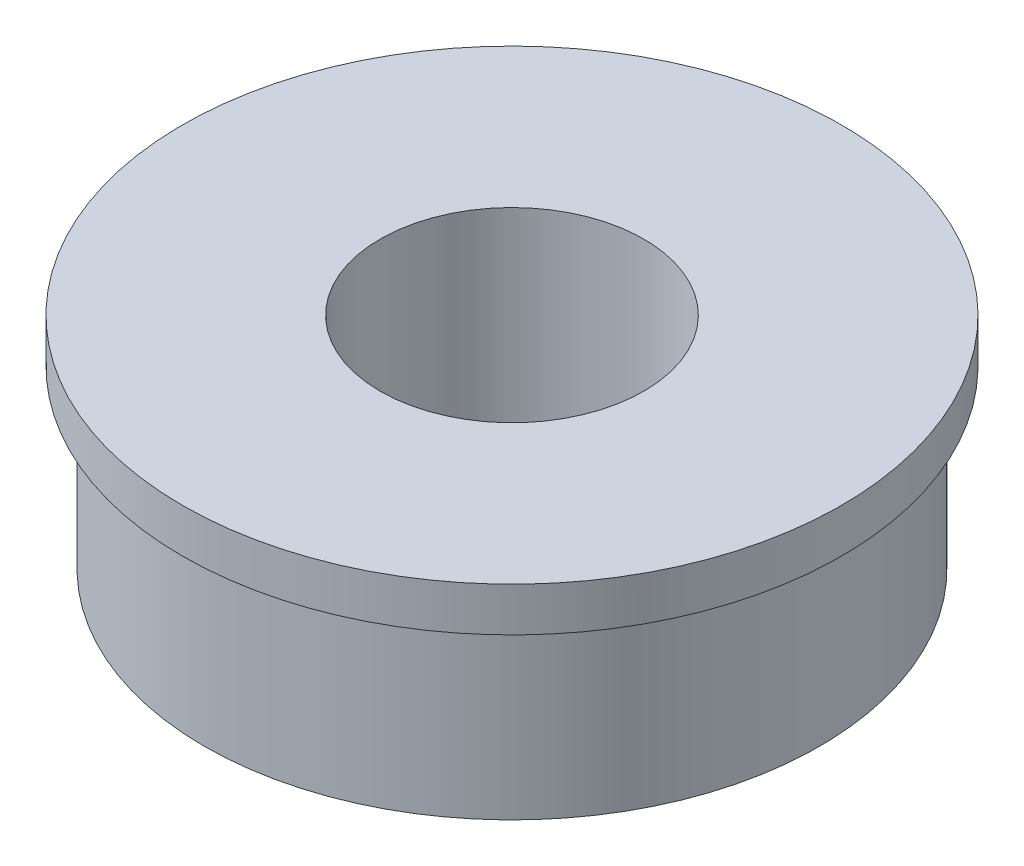
ISO-10303-21;
HEADER;
FILE_DESCRIPTION(('STEP AP214'),'2;1');
FILE_NAME('part.step','',(''),(''),'','','');
FILE_SCHEMA(('AUTOMOTIVE_DESIGN { 1 0 10303 214 1 1 1 1 }'));
ENDSEC;
DATA;
#1=APPLICATION_CONTEXT('core data for automotive mechanical design processes');
#2=APPLICATION_PROTOCOL_DEFINITION('international standard','automotive_design',2000,#1);
#3=PRODUCT_CONTEXT('',#1,'mechanical');
#4=PRODUCT('Part','Part','',(#3));
#5=PRODUCT_RELATED_PRODUCT_CATEGORY('part','',(#4));
#6=PRODUCT_DEFINITION_FORMATION('','',#4);
#7=PRODUCT_DEFINITION_CONTEXT('part definition',#1,'design');
#8=PRODUCT_DEFINITION('design','',#6,#7);
#9=PRODUCT_DEFINITION_SHAPE('','',#8);
#10=(LENGTH_UNIT() NAMED_UNIT(*) SI_UNIT(.MILLI.,.METRE.));
#11=(NAMED_UNIT(*) PLANE_ANGLE_UNIT() SI_UNIT($,.RADIAN.));
#12=(NAMED_UNIT(*) SI_UNIT($,.STERADIAN.) SOLID_ANGLE_UNIT());
#13=UNCERTAINTY_MEASURE_WITH_UNIT(LENGTH_MEASURE(1.E-05),#10,'distance_accuracy_value','');
#14=(GEOMETRIC_REPRESENTATION_CONTEXT(3) GLOBAL_UNCERTAINTY_ASSIGNED_CONTEXT((#13)) GLOBAL_UNIT_ASSIGNED_CONTEXT((#10,
#11,#12)) REPRESENTATION_CONTEXT('',''));
#15=CARTESIAN_POINT('',(0.,0.,0.));
#16=DIRECTION('',(0.,0.,1.));
#17=DIRECTION('',(1.,0.,0.));
#18=AXIS2_PLACEMENT_3D('',#15,#16,#17);
#19=CARTESIAN_POINT('',(0.,-5.,0.));
#20=DIRECTION('',(0.,1.,0.));
#21=DIRECTION('',(0.,0.,1.));
#22=AXIS2_PLACEMENT_3D('',#19,#20,#21);
#23=CYLINDRICAL_SURFACE('',#22,7.5);
#24=CARTESIAN_POINT('',(0.,0.,0.));
#25=DIRECTION('',(0.,1.,0.));
#26=DIRECTION('',(0.,0.,1.));
#27=AXIS2_PLACEMENT_3D('',#24,#25,#26);
#28=CIRCLE('',#27,7.5);
#29=CARTESIAN_POINT('',(0.,0.,7.5));
#30=VERTEX_POINT('',#29);
#31=EDGE_CURVE('E10',#30,#30,#28,.T.);
#32=ORIENTED_EDGE('',*,*,#31,.F.);
#33=EDGE_LOOP('',(#32));
#34=FACE_BOUND('',#33,.T.);
#35=CARTESIAN_POINT('',(0.,-1.,0.));
#36=DIRECTION('',(0.,-1.,0.));
#37=DIRECTION('',(0.,0.,-1.));
#38=AXIS2_PLACEMENT_3D('',#35,#36,#37);
#39=CIRCLE('',#38,7.5);
#40=CARTESIAN_POINT('',(0.,-1.,-7.5));
#41=VERTEX_POINT('',#40);
#42=EDGE_CURVE('E61',#41,#41,#39,.T.);
#43=ORIENTED_EDGE('',*,*,#42,.F.);
#44=EDGE_LOOP('',(#43));
#45=FACE_BOUND('',#44,.T.);
#46=ADVANCED_FACE('F43',(#34,#45),#23,.T.);
#47=CARTESIAN_POINT('',(0.,-5.,0.));
#48=DIRECTION('',(0.,1.,0.));
#49=DIRECTION('',(0.,0.,1.));
#50=AXIS2_PLACEMENT_3D('',#47,#48,#49);
#51=PLANE('',#50);
#52=CARTESIAN_POINT('',(0.,-5.,0.));
#53=DIRECTION('',(0.,1.,0.));
#54=DIRECTION('',(0.,0.,1.));
#55=AXIS2_PLACEMENT_3D('',#52,#53,#54);
#56=CIRCLE('',#55,3.);
#57=CARTESIAN_POINT('',(0.,-5.,3.));
#58=VERTEX_POINT('',#57);
#59=EDGE_CURVE('E50',#58,#58,#56,.T.);
#60=ORIENTED_EDGE('',*,*,#59,.T.);
#61=EDGE_LOOP('',(#60));
#62=FACE_BOUND('',#61,.T.);
#63=CARTESIAN_POINT('',(0.,-5.,0.));
#64=DIRECTION('',(0.,-1.,0.));
#65=DIRECTION('',(0.,0.,-1.));
#66=AXIS2_PLACEMENT_3D('',#63,#64,#65);
#67=CIRCLE('',#66,7.);
#68=CARTESIAN_POINT('',(0.,-5.,-7.));
#69=VERTEX_POINT('',#68);
#70=EDGE_CURVE('E67',#69,#69,#67,.T.);
#71=ORIENTED_EDGE('',*,*,#70,.T.);
#72=EDGE_LOOP('',(#71));
#73=FACE_BOUND('',#72,.T.);
#74=ADVANCED_FACE('F86',(#62,#73),#51,.F.);
#75=CARTESIAN_POINT('',(0.,0.,0.));
#76=DIRECTION('',(0.,1.,0.));
#77=DIRECTION('',(0.,0.,1.));
#78=AXIS2_PLACEMENT_3D('',#75,#76,#77);
#79=PLANE('',#78);
#80=CARTESIAN_POINT('',(0.,0.,0.));
#81=DIRECTION('',(0.,1.,0.));
#82=DIRECTION('',(0.,0.,1.));
#83=AXIS2_PLACEMENT_3D('',#80,#81,#82);
#84=CIRCLE('',#83,3.);
#85=CARTESIAN_POINT('',(0.,0.,3.));
#86=VERTEX_POINT('',#85);
#87=EDGE_CURVE('E55',#86,#86,#84,.T.);
#88=ORIENTED_EDGE('',*,*,#87,.F.);
#89=EDGE_LOOP('',(#88));
#90=FACE_BOUND('',#89,.T.);
#91=ORIENTED_EDGE('',*,*,#31,.T.);
#92=EDGE_LOOP('',(#91));
#93=FACE_BOUND('',#92,.T.);
#94=ADVANCED_FACE('F92',(#90,#93),#79,.T.);
#95=CARTESIAN_POINT('',(0.,-5.,0.));
#96=DIRECTION('',(0.,1.,0.));
#97=DIRECTION('',(0.,0.,1.));
#98=AXIS2_PLACEMENT_3D('',#95,#96,#97);
#99=CYLINDRICAL_SURFACE('',#98,3.);
#100=ORIENTED_EDGE('',*,*,#59,.F.);
#101=EDGE_LOOP('',(#100));
#102=FACE_BOUND('',#101,.T.);
#103=ORIENTED_EDGE('',*,*,#87,.T.);
#104=EDGE_LOOP('',(#103));
#105=FACE_BOUND('',#104,.T.);
#106=ADVANCED_FACE('F81',(#102,#105),#99,.F.);
#107=CARTESIAN_POINT('',(0.,-1.,0.));
#108=DIRECTION('',(0.,-1.,0.));
#109=DIRECTION('',(0.,0.,-1.));
#110=AXIS2_PLACEMENT_3D('',#107,#108,#109);
#111=PLANE('',#110);
#112=CARTESIAN_POINT('',(0.,-1.,0.));
#113=DIRECTION('',(0.,-1.,0.));
#114=DIRECTION('',(0.,0.,-1.));
#115=AXIS2_PLACEMENT_3D('',#112,#113,#114);
#116=CIRCLE('',#115,7.);
#117=CARTESIAN_POINT('',(0.,-1.,-7.));
#118=VERTEX_POINT('',#117);
#119=EDGE_CURVE('E66',#118,#118,#116,.T.);
#120=ORIENTED_EDGE('',*,*,#119,.F.);
#121=EDGE_LOOP('',(#120));
#122=FACE_BOUND('',#121,.T.);
#123=ORIENTED_EDGE('',*,*,#42,.T.);
#124=EDGE_LOOP('',(#123));
#125=FACE_BOUND('',#124,.T.);
#126=ADVANCED_FACE('F78',(#122,#125),#111,.T.);
#127=CARTESIAN_POINT('',(0.,-1.,0.));
#128=DIRECTION('',(0.,-1.,0.));
#129=DIRECTION('',(0.,0.,-1.));
#130=AXIS2_PLACEMENT_3D('',#127,#128,#129);
#131=CYLINDRICAL_SURFACE('',#130,7.);
#132=ORIENTED_EDGE('',*,*,#119,.T.);
#133=EDGE_LOOP('',(#132));
#134=FACE_BOUND('',#133,.T.);
#135=ORIENTED_EDGE('',*,*,#70,.F.);
#136=EDGE_LOOP('',(#135));
#137=FACE_BOUND('',#136,.T.);
#138=ADVANCED_FACE('F75',(#134,#137),#131,.T.);
#139=CLOSED_SHELL('',(#46,#74,#94,#106,#126,#138));
#140=MANIFOLD_SOLID_BREP('B2',#139);
#141=ADVANCED_BREP_SHAPE_REPRESENTATION('',(#18,#140),#14);
#142=SHAPE_DEFINITION_REPRESENTATION(#9,#141);
ENDSEC;
END-ISO-10303-21;
